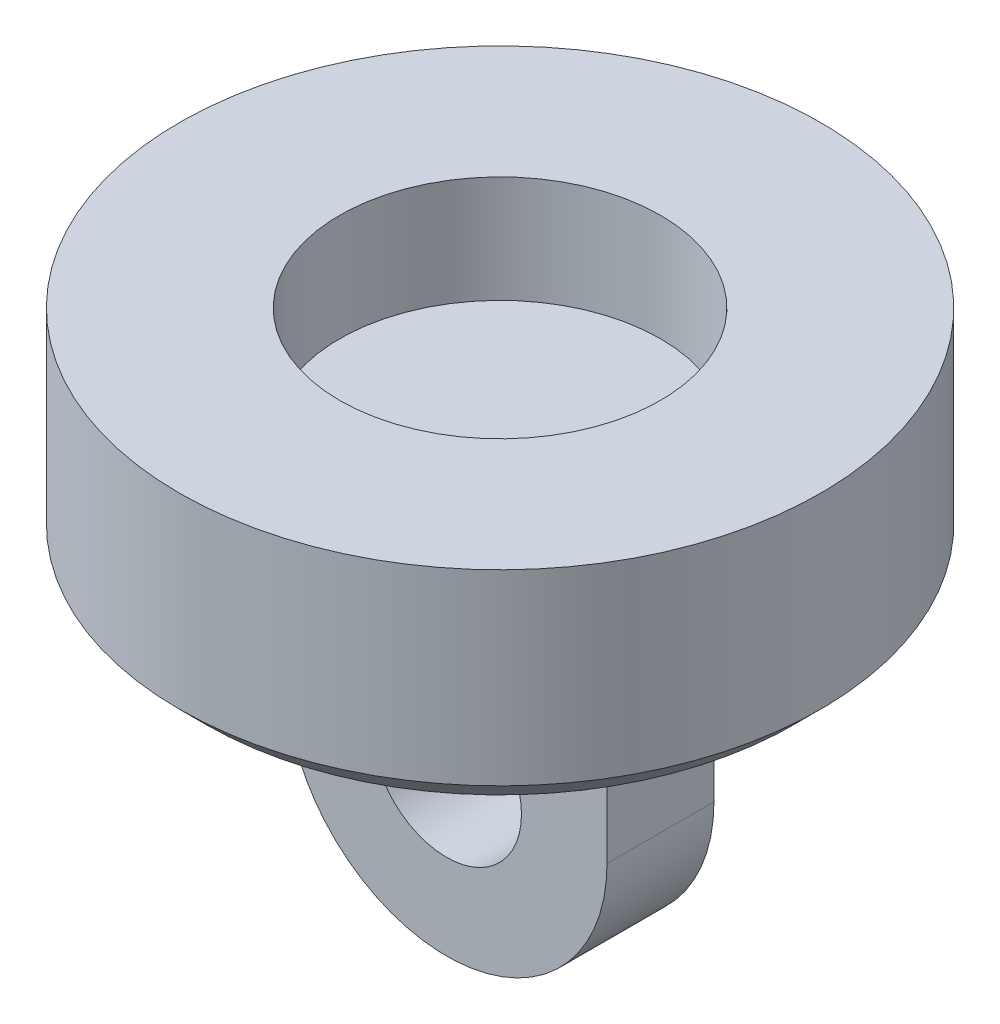
ISO-10303-21;
HEADER;
FILE_DESCRIPTION(('STEP AP214'),'2;1');
FILE_NAME('part.step','',(''),(''),'','','');
FILE_SCHEMA(('AUTOMOTIVE_DESIGN { 1 0 10303 214 1 1 1 1 }'));
ENDSEC;
DATA;
#1=APPLICATION_CONTEXT('core data for automotive mechanical design processes');
#2=APPLICATION_PROTOCOL_DEFINITION('international standard','automotive_design',2000,#1);
#3=PRODUCT_CONTEXT('',#1,'mechanical');
#4=PRODUCT('Part','Part','',(#3));
#5=PRODUCT_RELATED_PRODUCT_CATEGORY('part','',(#4));
#6=PRODUCT_DEFINITION_FORMATION('','',#4);
#7=PRODUCT_DEFINITION_CONTEXT('part definition',#1,'design');
#8=PRODUCT_DEFINITION('design','',#6,#7);
#9=PRODUCT_DEFINITION_SHAPE('','',#8);
#10=(LENGTH_UNIT() NAMED_UNIT(*) SI_UNIT(.MILLI.,.METRE.));
#11=(NAMED_UNIT(*) PLANE_ANGLE_UNIT() SI_UNIT($,.RADIAN.));
#12=(NAMED_UNIT(*) SI_UNIT($,.STERADIAN.) SOLID_ANGLE_UNIT());
#13=UNCERTAINTY_MEASURE_WITH_UNIT(LENGTH_MEASURE(1.E-05),#10,'distance_accuracy_value','');
#14=(GEOMETRIC_REPRESENTATION_CONTEXT(3) GLOBAL_UNCERTAINTY_ASSIGNED_CONTEXT((#13)) GLOBAL_UNIT_ASSIGNED_CONTEXT((#10,
#11,#12)) REPRESENTATION_CONTEXT('',''));
#15=CARTESIAN_POINT('',(0.,0.,0.));
#16=DIRECTION('',(0.,0.,1.));
#17=DIRECTION('',(1.,0.,0.));
#18=AXIS2_PLACEMENT_3D('',#15,#16,#17);
#19=CARTESIAN_POINT('',(0.,-7.5,2.5));
#20=DIRECTION('',(0.,0.,1.));
#21=DIRECTION('',(1.,0.,0.));
#22=AXIS2_PLACEMENT_3D('',#19,#20,#21);
#23=CYLINDRICAL_SURFACE('',#22,7.5);
#24=DIRECTION('',(0.,0.,1.));
#25=VECTOR('',#24,1.);
#26=CARTESIAN_POINT('',(7.5,-7.5,-2.5));
#27=LINE('',#26,#25);
#28=CARTESIAN_POINT('',(7.5,-7.5,2.5));
#29=VERTEX_POINT('',#28);
#30=CARTESIAN_POINT('',(7.5,-7.5,-2.5));
#31=VERTEX_POINT('',#30);
#32=EDGE_CURVE('E142',#29,#31,#27,.F.);
#33=ORIENTED_EDGE('',*,*,#32,.F.);
#34=CARTESIAN_POINT('',(0.,-7.5,2.5));
#35=DIRECTION('',(0.,0.,-1.));
#36=DIRECTION('',(-1.,0.,0.));
#37=AXIS2_PLACEMENT_3D('',#34,#35,#36);
#38=CIRCLE('',#37,7.5);
#39=CARTESIAN_POINT('',(-7.5,-7.5,2.5));
#40=VERTEX_POINT('',#39);
#41=EDGE_CURVE('E62',#40,#29,#38,.F.);
#42=ORIENTED_EDGE('',*,*,#41,.F.);
#43=DIRECTION('',(0.,0.,1.));
#44=VECTOR('',#43,1.);
#45=CARTESIAN_POINT('',(-7.5,-7.5,-2.5));
#46=LINE('',#45,#44);
#47=CARTESIAN_POINT('',(-7.5,-7.5,-2.5));
#48=VERTEX_POINT('',#47);
#49=EDGE_CURVE('E93',#48,#40,#46,.T.);
#50=ORIENTED_EDGE('',*,*,#49,.F.);
#51=CARTESIAN_POINT('',(0.,-7.5,-2.5));
#52=DIRECTION('',(0.,0.,1.));
#53=DIRECTION('',(1.,0.,0.));
#54=AXIS2_PLACEMENT_3D('',#51,#52,#53);
#55=CIRCLE('',#54,7.5);
#56=EDGE_CURVE('E70',#31,#48,#55,.F.);
#57=ORIENTED_EDGE('',*,*,#56,.F.);
#58=EDGE_LOOP('',(#33,#42,#50,#57));
#59=FACE_BOUND('',#58,.T.);
#60=ADVANCED_FACE('F46',(#59),#23,.T.);
#61=CARTESIAN_POINT('',(0.,0.,0.));
#62=DIRECTION('',(0.,1.,0.));
#63=DIRECTION('',(0.,0.,1.));
#64=AXIS2_PLACEMENT_3D('',#61,#62,#63);
#65=PLANE('',#64);
#66=CARTESIAN_POINT('',(0.,0.,0.));
#67=DIRECTION('',(0.,1.,0.));
#68=DIRECTION('',(0.,0.,1.));
#69=AXIS2_PLACEMENT_3D('',#66,#67,#68);
#70=CIRCLE('',#69,13.75);
#71=CARTESIAN_POINT('',(0.,0.,13.75));
#72=VERTEX_POINT('',#71);
#73=EDGE_CURVE('E12',#72,#72,#70,.F.);
#74=ORIENTED_EDGE('',*,*,#73,.T.);
#75=EDGE_LOOP('',(#74));
#76=FACE_BOUND('',#75,.T.);
#77=DIRECTION('',(0.,0.,1.));
#78=VECTOR('',#77,1.);
#79=CARTESIAN_POINT('',(7.5,0.,-2.5));
#80=LINE('',#79,#78);
#81=CARTESIAN_POINT('',(7.5,0.,-2.5));
#82=VERTEX_POINT('',#81);
#83=CARTESIAN_POINT('',(7.5,0.,2.5));
#84=VERTEX_POINT('',#83);
#85=EDGE_CURVE('E114',#82,#84,#80,.T.);
#86=ORIENTED_EDGE('',*,*,#85,.F.);
#87=DIRECTION('',(1.,0.,0.));
#88=VECTOR('',#87,1.);
#89=CARTESIAN_POINT('',(-7.5,0.,-2.5));
#90=LINE('',#89,#88);
#91=CARTESIAN_POINT('',(-7.5,0.,-2.5));
#92=VERTEX_POINT('',#91);
#93=EDGE_CURVE('E108',#92,#82,#90,.T.);
#94=ORIENTED_EDGE('',*,*,#93,.F.);
#95=DIRECTION('',(0.,0.,-1.));
#96=VECTOR('',#95,1.);
#97=CARTESIAN_POINT('',(-7.5,0.,-2.5));
#98=LINE('',#97,#96);
#99=CARTESIAN_POINT('',(-7.5,0.,2.5));
#100=VERTEX_POINT('',#99);
#101=EDGE_CURVE('E92',#100,#92,#98,.T.);
#102=ORIENTED_EDGE('',*,*,#101,.F.);
#103=DIRECTION('',(-1.,0.,0.));
#104=VECTOR('',#103,1.);
#105=CARTESIAN_POINT('',(-7.5,0.,2.5));
#106=LINE('',#105,#104);
#107=EDGE_CURVE('E105',#84,#100,#106,.T.);
#108=ORIENTED_EDGE('',*,*,#107,.F.);
#109=EDGE_LOOP('',(#86,#94,#102,#108));
#110=FACE_BOUND('',#109,.T.);
#111=ADVANCED_FACE('F104',(#76,#110),#65,.F.);
#112=CARTESIAN_POINT('',(0.,10.,0.));
#113=DIRECTION('',(0.,1.,0.));
#114=DIRECTION('',(0.,0.,1.));
#115=AXIS2_PLACEMENT_3D('',#112,#113,#114);
#116=PLANE('',#115);
#117=CARTESIAN_POINT('',(0.,10.,0.));
#118=DIRECTION('',(0.,1.,0.));
#119=DIRECTION('',(0.,0.,1.));
#120=AXIS2_PLACEMENT_3D('',#117,#118,#119);
#121=CIRCLE('',#120,15.);
#122=CARTESIAN_POINT('',(0.,10.,15.));
#123=VERTEX_POINT('',#122);
#124=EDGE_CURVE('E134',#123,#123,#121,.T.);
#125=ORIENTED_EDGE('',*,*,#124,.T.);
#126=EDGE_LOOP('',(#125));
#127=FACE_BOUND('',#126,.T.);
#128=CARTESIAN_POINT('',(0.,10.,0.));
#129=DIRECTION('',(0.,1.,0.));
#130=DIRECTION('',(0.,0.,1.));
#131=AXIS2_PLACEMENT_3D('',#128,#129,#130);
#132=CIRCLE('',#131,7.5);
#133=CARTESIAN_POINT('',(0.,10.,7.5));
#134=VERTEX_POINT('',#133);
#135=EDGE_CURVE('E130',#134,#134,#132,.T.);
#136=ORIENTED_EDGE('',*,*,#135,.F.);
#137=EDGE_LOOP('',(#136));
#138=FACE_BOUND('',#137,.T.);
#139=ADVANCED_FACE('F177',(#127,#138),#116,.T.);
#140=CARTESIAN_POINT('',(0.,10.,0.));
#141=DIRECTION('',(0.,-1.,0.));
#142=DIRECTION('',(0.,0.,-1.));
#143=AXIS2_PLACEMENT_3D('',#140,#141,#142);
#144=CYLINDRICAL_SURFACE('',#143,15.);
#145=CARTESIAN_POINT('',(0.,1.25000000000001,0.));
#146=DIRECTION('',(0.,1.,0.));
#147=DIRECTION('',(0.,0.,1.));
#148=AXIS2_PLACEMENT_3D('',#145,#146,#147);
#149=CIRCLE('',#148,15.);
#150=CARTESIAN_POINT('',(0.,1.25000000000001,15.));
#151=VERTEX_POINT('',#150);
#152=EDGE_CURVE('E55',#151,#151,#149,.T.);
#153=ORIENTED_EDGE('',*,*,#152,.T.);
#154=EDGE_LOOP('',(#153));
#155=FACE_BOUND('',#154,.T.);
#156=ORIENTED_EDGE('',*,*,#124,.F.);
#157=EDGE_LOOP('',(#156));
#158=FACE_BOUND('',#157,.T.);
#159=ADVANCED_FACE('F159',(#155,#158),#144,.T.);
#160=CARTESIAN_POINT('',(0.,10.,0.));
#161=DIRECTION('',(0.,-1.,0.));
#162=DIRECTION('',(0.,0.,-1.));
#163=AXIS2_PLACEMENT_3D('',#160,#161,#162);
#164=CYLINDRICAL_SURFACE('',#163,7.5);
#165=CARTESIAN_POINT('',(0.,5.,0.));
#166=DIRECTION('',(0.,1.,0.));
#167=DIRECTION('',(0.,0.,1.));
#168=AXIS2_PLACEMENT_3D('',#165,#166,#167);
#169=CIRCLE('',#168,7.5);
#170=CARTESIAN_POINT('',(0.,5.,7.5));
#171=VERTEX_POINT('',#170);
#172=EDGE_CURVE('E138',#171,#171,#169,.T.);
#173=ORIENTED_EDGE('',*,*,#172,.F.);
#174=EDGE_LOOP('',(#173));
#175=FACE_BOUND('',#174,.T.);
#176=ORIENTED_EDGE('',*,*,#135,.T.);
#177=EDGE_LOOP('',(#176));
#178=FACE_BOUND('',#177,.T.);
#179=ADVANCED_FACE('F185',(#175,#178),#164,.F.);
#180=CARTESIAN_POINT('',(0.,5.,0.));
#181=DIRECTION('',(0.,1.,0.));
#182=DIRECTION('',(0.,0.,1.));
#183=AXIS2_PLACEMENT_3D('',#180,#181,#182);
#184=PLANE('',#183);
#185=ORIENTED_EDGE('',*,*,#172,.T.);
#186=EDGE_LOOP('',(#185));
#187=FACE_BOUND('',#186,.T.);
#188=ADVANCED_FACE('F192',(#187),#184,.T.);
#189=CARTESIAN_POINT('',(7.5,-15.,-2.5));
#190=DIRECTION('',(-1.,0.,0.));
#191=DIRECTION('',(0.,0.,1.));
#192=AXIS2_PLACEMENT_3D('',#189,#190,#191);
#193=PLANE('',#192);
#194=DIRECTION('',(0.,1.,0.));
#195=VECTOR('',#194,1.);
#196=CARTESIAN_POINT('',(7.5,-15.,2.5));
#197=LINE('',#196,#195);
#198=EDGE_CURVE('E97',#29,#84,#197,.T.);
#199=ORIENTED_EDGE('',*,*,#198,.F.);
#200=ORIENTED_EDGE('',*,*,#32,.T.);
#201=DIRECTION('',(0.,1.,0.));
#202=VECTOR('',#201,1.);
#203=CARTESIAN_POINT('',(7.5,-15.,-2.5));
#204=LINE('',#203,#202);
#205=EDGE_CURVE('E123',#31,#82,#204,.T.);
#206=ORIENTED_EDGE('',*,*,#205,.T.);
#207=ORIENTED_EDGE('',*,*,#85,.T.);
#208=EDGE_LOOP('',(#199,#200,#206,#207));
#209=FACE_BOUND('',#208,.T.);
#210=ADVANCED_FACE('F196',(#209),#193,.F.);
#211=CARTESIAN_POINT('',(-7.5,-15.,2.5));
#212=DIRECTION('',(0.,0.,-1.));
#213=DIRECTION('',(-1.,0.,0.));
#214=AXIS2_PLACEMENT_3D('',#211,#212,#213);
#215=PLANE('',#214);
#216=CARTESIAN_POINT('',(0.,-7.5,2.5));
#217=DIRECTION('',(0.,0.,1.));
#218=DIRECTION('',(1.,0.,0.));
#219=AXIS2_PLACEMENT_3D('',#216,#217,#218);
#220=CIRCLE('',#219,3.5);
#221=CARTESIAN_POINT('',(3.5,-7.5,2.5));
#222=VERTEX_POINT('',#221);
#223=EDGE_CURVE('E154',#222,#222,#220,.T.);
#224=ORIENTED_EDGE('',*,*,#223,.F.);
#225=EDGE_LOOP('',(#224));
#226=FACE_BOUND('',#225,.T.);
#227=DIRECTION('',(0.,1.,0.));
#228=VECTOR('',#227,1.);
#229=CARTESIAN_POINT('',(-7.5,-15.,2.5));
#230=LINE('',#229,#228);
#231=EDGE_CURVE('E88',#40,#100,#230,.T.);
#232=ORIENTED_EDGE('',*,*,#231,.F.);
#233=ORIENTED_EDGE('',*,*,#41,.T.);
#234=ORIENTED_EDGE('',*,*,#198,.T.);
#235=ORIENTED_EDGE('',*,*,#107,.T.);
#236=EDGE_LOOP('',(#232,#233,#234,#235));
#237=FACE_BOUND('',#236,.T.);
#238=ADVANCED_FACE('F111',(#226,#237),#215,.F.);
#239=CARTESIAN_POINT('',(-7.5,-15.,-2.5));
#240=DIRECTION('',(1.,0.,0.));
#241=DIRECTION('',(0.,0.,-1.));
#242=AXIS2_PLACEMENT_3D('',#239,#240,#241);
#243=PLANE('',#242);
#244=DIRECTION('',(0.,1.,0.));
#245=VECTOR('',#244,1.);
#246=CARTESIAN_POINT('',(-7.5,-15.,-2.5));
#247=LINE('',#246,#245);
#248=EDGE_CURVE('E98',#48,#92,#247,.T.);
#249=ORIENTED_EDGE('',*,*,#248,.F.);
#250=ORIENTED_EDGE('',*,*,#49,.T.);
#251=ORIENTED_EDGE('',*,*,#231,.T.);
#252=ORIENTED_EDGE('',*,*,#101,.T.);
#253=EDGE_LOOP('',(#249,#250,#251,#252));
#254=FACE_BOUND('',#253,.T.);
#255=ADVANCED_FACE('F91',(#254),#243,.F.);
#256=CARTESIAN_POINT('',(-7.5,-15.,-2.5));
#257=DIRECTION('',(0.,0.,1.));
#258=DIRECTION('',(1.,0.,0.));
#259=AXIS2_PLACEMENT_3D('',#256,#257,#258);
#260=PLANE('',#259);
#261=CARTESIAN_POINT('',(0.,-7.5,-2.5));
#262=DIRECTION('',(0.,0.,1.));
#263=DIRECTION('',(1.,0.,0.));
#264=AXIS2_PLACEMENT_3D('',#261,#262,#263);
#265=CIRCLE('',#264,3.5);
#266=CARTESIAN_POINT('',(3.5,-7.5,-2.5));
#267=VERTEX_POINT('',#266);
#268=EDGE_CURVE('E117',#267,#267,#265,.T.);
#269=ORIENTED_EDGE('',*,*,#268,.T.);
#270=EDGE_LOOP('',(#269));
#271=FACE_BOUND('',#270,.T.);
#272=ORIENTED_EDGE('',*,*,#205,.F.);
#273=ORIENTED_EDGE('',*,*,#56,.T.);
#274=ORIENTED_EDGE('',*,*,#248,.T.);
#275=ORIENTED_EDGE('',*,*,#93,.T.);
#276=EDGE_LOOP('',(#272,#273,#274,#275));
#277=FACE_BOUND('',#276,.T.);
#278=ADVANCED_FACE('F168',(#271,#277),#260,.F.);
#279=CARTESIAN_POINT('',(0.,-7.5,-15.));
#280=DIRECTION('',(0.,0.,1.));
#281=DIRECTION('',(1.,0.,0.));
#282=AXIS2_PLACEMENT_3D('',#279,#280,#281);
#283=CYLINDRICAL_SURFACE('',#282,3.5);
#284=ORIENTED_EDGE('',*,*,#223,.T.);
#285=EDGE_LOOP('',(#284));
#286=FACE_BOUND('',#285,.T.);
#287=ORIENTED_EDGE('',*,*,#268,.F.);
#288=EDGE_LOOP('',(#287));
#289=FACE_BOUND('',#288,.T.);
#290=ADVANCED_FACE('F163',(#286,#289),#283,.F.);
#291=CARTESIAN_POINT('',(0.,1.25000000000001,0.));
#292=DIRECTION('',(0.,1.,0.));
#293=DIRECTION('',(0.,0.,1.));
#294=AXIS2_PLACEMENT_3D('',#291,#292,#293);
#295=CONICAL_SURFACE('',#294,15.,0.785398163397451);
#296=ORIENTED_EDGE('',*,*,#73,.F.);
#297=EDGE_LOOP('',(#296));
#298=FACE_BOUND('',#297,.T.);
#299=ORIENTED_EDGE('',*,*,#152,.F.);
#300=EDGE_LOOP('',(#299));
#301=FACE_BOUND('',#300,.T.);
#302=ADVANCED_FACE('F48',(#298,#301),#295,.T.);
#303=CLOSED_SHELL('',(#60,#111,#139,#159,#179,#188,#210,#238,#255,#278,#290,#302));
#304=MANIFOLD_SOLID_BREP('B2',#303);
#305=ADVANCED_BREP_SHAPE_REPRESENTATION('',(#18,#304),#14);
#306=SHAPE_DEFINITION_REPRESENTATION(#9,#305);
ENDSEC;
END-ISO-10303-21;
